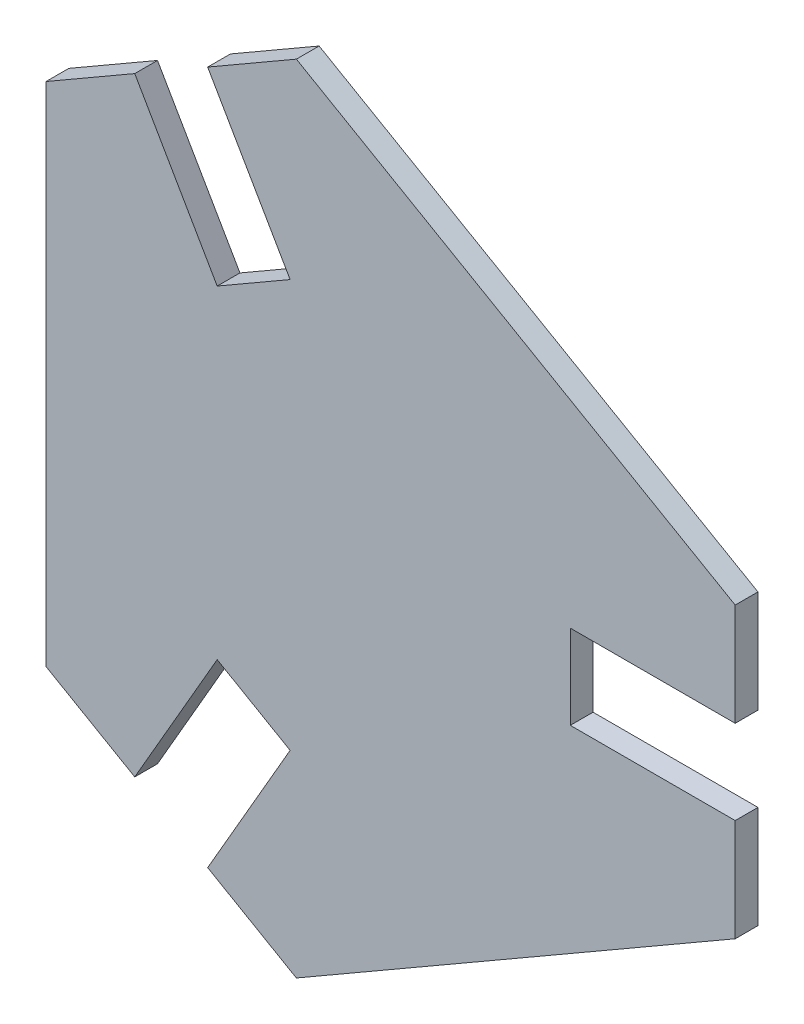
ISO-10303-21;
HEADER;
FILE_DESCRIPTION(('STEP AP214'),'2;1');
FILE_NAME('part.step','',(''),(''),'','','');
FILE_SCHEMA(('AUTOMOTIVE_DESIGN { 1 0 10303 214 1 1 1 1 }'));
ENDSEC;
DATA;
#1=APPLICATION_CONTEXT('core data for automotive mechanical design processes');
#2=APPLICATION_PROTOCOL_DEFINITION('international standard','automotive_design',2000,#1);
#3=PRODUCT_CONTEXT('',#1,'mechanical');
#4=PRODUCT('Part','Part','',(#3));
#5=PRODUCT_RELATED_PRODUCT_CATEGORY('part','',(#4));
#6=PRODUCT_DEFINITION_FORMATION('','',#4);
#7=PRODUCT_DEFINITION_CONTEXT('part definition',#1,'design');
#8=PRODUCT_DEFINITION('design','',#6,#7);
#9=PRODUCT_DEFINITION_SHAPE('','',#8);
#10=(LENGTH_UNIT() NAMED_UNIT(*) SI_UNIT(.MILLI.,.METRE.));
#11=(NAMED_UNIT(*) PLANE_ANGLE_UNIT() SI_UNIT($,.RADIAN.));
#12=(NAMED_UNIT(*) SI_UNIT($,.STERADIAN.) SOLID_ANGLE_UNIT());
#13=UNCERTAINTY_MEASURE_WITH_UNIT(LENGTH_MEASURE(1.E-05),#10,'distance_accuracy_value','');
#14=(GEOMETRIC_REPRESENTATION_CONTEXT(3) GLOBAL_UNCERTAINTY_ASSIGNED_CONTEXT((#13)) GLOBAL_UNIT_ASSIGNED_CONTEXT((#10,
#11,#12)) REPRESENTATION_CONTEXT('',''));
#15=CARTESIAN_POINT('',(0.,0.,0.));
#16=DIRECTION('',(0.,0.,1.));
#17=DIRECTION('',(1.,0.,0.));
#18=AXIS2_PLACEMENT_3D('',#15,#16,#17);
#19=CARTESIAN_POINT('',(-49.3107349850041,66.9086983525934,5.));
#20=DIRECTION('',(0.500000000000001,-0.866025403784438,0.));
#21=DIRECTION('',(0.866025403784438,0.500000000000001,0.));
#22=AXIS2_PLACEMENT_3D('',#19,#20,#21);
#23=PLANE('',#22);
#24=DIRECTION('',(-0.866025403784438,-0.500000000000001,0.));
#25=VECTOR('',#24,1.);
#26=CARTESIAN_POINT('',(-49.3107349850041,66.9086983525934,0.));
#27=LINE('',#26,#25);
#28=CARTESIAN_POINT('',(-49.3107349850041,66.9086983525934,0.));
#29=VERTEX_POINT('',#28);
#30=CARTESIAN_POINT('',(-68.7963065701539,55.6586983525934,0.));
#31=VERTEX_POINT('',#30);
#32=EDGE_CURVE('E188',#29,#31,#27,.T.);
#33=ORIENTED_EDGE('',*,*,#32,.T.);
#34=DIRECTION('',(0.,0.,-1.));
#35=VECTOR('',#34,1.);
#36=CARTESIAN_POINT('',(-68.7963065701539,55.6586983525934,5.));
#37=LINE('',#36,#35);
#38=CARTESIAN_POINT('',(-68.7963065701539,55.6586983525934,5.));
#39=VERTEX_POINT('',#38);
#40=EDGE_CURVE('E11',#39,#31,#37,.T.);
#41=ORIENTED_EDGE('',*,*,#40,.F.);
#42=DIRECTION('',(-0.866025403784438,-0.500000000000001,0.));
#43=VECTOR('',#42,1.);
#44=CARTESIAN_POINT('',(-49.3107349850041,66.9086983525934,5.));
#45=LINE('',#44,#43);
#46=CARTESIAN_POINT('',(-49.3107349850041,66.9086983525934,5.));
#47=VERTEX_POINT('',#46);
#48=EDGE_CURVE('E228',#47,#39,#45,.T.);
#49=ORIENTED_EDGE('',*,*,#48,.F.);
#50=DIRECTION('',(0.,0.,-1.));
#51=VECTOR('',#50,1.);
#52=CARTESIAN_POINT('',(-49.3107349850041,66.9086983525934,5.));
#53=LINE('',#52,#51);
#54=EDGE_CURVE('E184',#47,#29,#53,.T.);
#55=ORIENTED_EDGE('',*,*,#54,.T.);
#56=EDGE_LOOP('',(#33,#41,#49,#55));
#57=FACE_BOUND('',#56,.T.);
#58=ADVANCED_FACE('F33',(#57),#23,.F.);
#59=CARTESIAN_POINT('',(-68.7963065701539,55.6586983525934,5.));
#60=DIRECTION('',(1.,0.,0.));
#61=DIRECTION('',(0.,1.,0.));
#62=AXIS2_PLACEMENT_3D('',#59,#60,#61);
#63=PLANE('',#62);
#64=DIRECTION('',(0.,-1.,0.));
#65=VECTOR('',#64,1.);
#66=CARTESIAN_POINT('',(-68.7963065701539,55.6586983525934,0.));
#67=LINE('',#66,#65);
#68=CARTESIAN_POINT('',(-68.7963065701539,-55.6586983525935,0.));
#69=VERTEX_POINT('',#68);
#70=EDGE_CURVE('E191',#31,#69,#67,.T.);
#71=ORIENTED_EDGE('',*,*,#70,.T.);
#72=DIRECTION('',(0.,0.,-1.));
#73=VECTOR('',#72,1.);
#74=CARTESIAN_POINT('',(-68.7963065701539,-55.6586983525935,5.));
#75=LINE('',#74,#73);
#76=CARTESIAN_POINT('',(-68.7963065701539,-55.6586983525935,5.));
#77=VERTEX_POINT('',#76);
#78=EDGE_CURVE('E41',#77,#69,#75,.T.);
#79=ORIENTED_EDGE('',*,*,#78,.F.);
#80=DIRECTION('',(0.,-1.,0.));
#81=VECTOR('',#80,1.);
#82=CARTESIAN_POINT('',(-68.7963065701539,55.6586983525934,5.));
#83=LINE('',#82,#81);
#84=EDGE_CURVE('E122',#39,#77,#83,.T.);
#85=ORIENTED_EDGE('',*,*,#84,.F.);
#86=ORIENTED_EDGE('',*,*,#40,.T.);
#87=EDGE_LOOP('',(#71,#79,#85,#86));
#88=FACE_BOUND('',#87,.T.);
#89=ADVANCED_FACE('F269',(#88),#63,.F.);
#90=CARTESIAN_POINT('',(-49.310734985004,-66.9086983525935,5.));
#91=DIRECTION('',(-0.499999999999999,-0.866025403784439,0.));
#92=DIRECTION('',(0.866025403784439,-0.499999999999999,0.));
#93=AXIS2_PLACEMENT_3D('',#90,#91,#92);
#94=PLANE('',#93);
#95=DIRECTION('',(-0.866025403784439,0.499999999999999,0.));
#96=VECTOR('',#95,1.);
#97=CARTESIAN_POINT('',(-49.310734985004,-66.9086983525935,0.));
#98=LINE('',#97,#96);
#99=CARTESIAN_POINT('',(-49.310734985004,-66.9086983525935,0.));
#100=VERTEX_POINT('',#99);
#101=EDGE_CURVE('E194',#100,#69,#98,.T.);
#102=ORIENTED_EDGE('',*,*,#101,.F.);
#103=DIRECTION('',(0.,0.,-1.));
#104=VECTOR('',#103,1.);
#105=CARTESIAN_POINT('',(-49.310734985004,-66.9086983525935,5.));
#106=LINE('',#105,#104);
#107=CARTESIAN_POINT('',(-49.310734985004,-66.9086983525935,5.));
#108=VERTEX_POINT('',#107);
#109=EDGE_CURVE('E262',#108,#100,#106,.T.);
#110=ORIENTED_EDGE('',*,*,#109,.F.);
#111=DIRECTION('',(-0.866025403784439,0.499999999999999,0.));
#112=VECTOR('',#111,1.);
#113=CARTESIAN_POINT('',(-49.310734985004,-66.9086983525935,5.));
#114=LINE('',#113,#112);
#115=EDGE_CURVE('E268',#108,#77,#114,.T.);
#116=ORIENTED_EDGE('',*,*,#115,.T.);
#117=ORIENTED_EDGE('',*,*,#78,.T.);
#118=EDGE_LOOP('',(#102,#110,#116,#117));
#119=FACE_BOUND('',#118,.T.);
#120=ADVANCED_FACE('F266',(#119),#94,.T.);
#121=CARTESIAN_POINT('',(-49.310734985004,-66.9086983525935,5.));
#122=DIRECTION('',(-0.866025403784439,0.5,0.));
#123=DIRECTION('',(-0.5,-0.866025403784439,0.));
#124=AXIS2_PLACEMENT_3D('',#121,#122,#123);
#125=PLANE('',#124);
#126=DIRECTION('',(0.5,0.866025403784439,0.));
#127=VECTOR('',#126,1.);
#128=CARTESIAN_POINT('',(-49.310734985004,-66.9086983525935,0.));
#129=LINE('',#128,#127);
#130=CARTESIAN_POINT('',(-31.198621019148,-35.5375967312531,0.));
#131=VERTEX_POINT('',#130);
#132=EDGE_CURVE('E197',#100,#131,#129,.T.);
#133=ORIENTED_EDGE('',*,*,#132,.T.);
#134=DIRECTION('',(0.,0.,-1.));
#135=VECTOR('',#134,1.);
#136=CARTESIAN_POINT('',(-31.198621019148,-35.5375967312531,5.));
#137=LINE('',#136,#135);
#138=CARTESIAN_POINT('',(-31.198621019148,-35.5375967312531,5.));
#139=VERTEX_POINT('',#138);
#140=EDGE_CURVE('E259',#139,#131,#137,.T.);
#141=ORIENTED_EDGE('',*,*,#140,.F.);
#142=DIRECTION('',(0.5,0.866025403784439,0.));
#143=VECTOR('',#142,1.);
#144=CARTESIAN_POINT('',(-49.310734985004,-66.9086983525935,5.));
#145=LINE('',#144,#143);
#146=EDGE_CURVE('E288',#108,#139,#145,.T.);
#147=ORIENTED_EDGE('',*,*,#146,.F.);
#148=ORIENTED_EDGE('',*,*,#109,.T.);
#149=EDGE_LOOP('',(#133,#141,#147,#148));
#150=FACE_BOUND('',#149,.T.);
#151=ADVANCED_FACE('F279',(#150),#125,.F.);
#152=CARTESIAN_POINT('',(-31.198621019148,-35.5375967312531,5.));
#153=DIRECTION('',(0.5,0.866025403784439,0.));
#154=DIRECTION('',(-0.866025403784439,0.5,0.));
#155=AXIS2_PLACEMENT_3D('',#152,#153,#154);
#156=PLANE('',#155);
#157=DIRECTION('',(0.866025403784439,-0.5,0.));
#158=VECTOR('',#157,1.);
#159=CARTESIAN_POINT('',(-31.198621019148,-35.5375967312531,0.));
#160=LINE('',#159,#158);
#161=CARTESIAN_POINT('',(-15.1771510491359,-44.7875967312531,0.));
#162=VERTEX_POINT('',#161);
#163=EDGE_CURVE('E199',#131,#162,#160,.T.);
#164=ORIENTED_EDGE('',*,*,#163,.T.);
#165=DIRECTION('',(0.,0.,-1.));
#166=VECTOR('',#165,1.);
#167=CARTESIAN_POINT('',(-15.1771510491359,-44.7875967312531,5.));
#168=LINE('',#167,#166);
#169=CARTESIAN_POINT('',(-15.1771510491359,-44.7875967312531,5.));
#170=VERTEX_POINT('',#169);
#171=EDGE_CURVE('E256',#170,#162,#168,.T.);
#172=ORIENTED_EDGE('',*,*,#171,.F.);
#173=DIRECTION('',(0.866025403784439,-0.5,0.));
#174=VECTOR('',#173,1.);
#175=CARTESIAN_POINT('',(-31.198621019148,-35.5375967312531,5.));
#176=LINE('',#175,#174);
#177=EDGE_CURVE('E285',#139,#170,#176,.T.);
#178=ORIENTED_EDGE('',*,*,#177,.F.);
#179=ORIENTED_EDGE('',*,*,#140,.T.);
#180=EDGE_LOOP('',(#164,#172,#178,#179));
#181=FACE_BOUND('',#180,.T.);
#182=ADVANCED_FACE('F283',(#181),#156,.F.);
#183=CARTESIAN_POINT('',(-15.1771510491359,-44.7875967312531,5.));
#184=DIRECTION('',(0.866025403784439,-0.5,0.));
#185=DIRECTION('',(0.5,0.866025403784439,0.));
#186=AXIS2_PLACEMENT_3D('',#183,#184,#185);
#187=PLANE('',#186);
#188=DIRECTION('',(-0.5,-0.866025403784439,0.));
#189=VECTOR('',#188,1.);
#190=CARTESIAN_POINT('',(-15.1771510491359,-44.7875967312531,0.));
#191=LINE('',#190,#189);
#192=CARTESIAN_POINT('',(-33.2892650149919,-76.1586983525935,0.));
#193=VERTEX_POINT('',#192);
#194=EDGE_CURVE('E201',#162,#193,#191,.T.);
#195=ORIENTED_EDGE('',*,*,#194,.T.);
#196=DIRECTION('',(0.,0.,-1.));
#197=VECTOR('',#196,1.);
#198=CARTESIAN_POINT('',(-33.2892650149919,-76.1586983525935,5.));
#199=LINE('',#198,#197);
#200=CARTESIAN_POINT('',(-33.2892650149919,-76.1586983525935,5.));
#201=VERTEX_POINT('',#200);
#202=EDGE_CURVE('E253',#201,#193,#199,.T.);
#203=ORIENTED_EDGE('',*,*,#202,.F.);
#204=DIRECTION('',(-0.5,-0.866025403784439,0.));
#205=VECTOR('',#204,1.);
#206=CARTESIAN_POINT('',(-15.1771510491359,-44.7875967312531,5.));
#207=LINE('',#206,#205);
#208=EDGE_CURVE('E287',#170,#201,#207,.T.);
#209=ORIENTED_EDGE('',*,*,#208,.F.);
#210=ORIENTED_EDGE('',*,*,#171,.T.);
#211=EDGE_LOOP('',(#195,#203,#209,#210));
#212=FACE_BOUND('',#211,.T.);
#213=ADVANCED_FACE('F340',(#212),#187,.F.);
#214=CARTESIAN_POINT('',(-33.2892650149919,-76.1586983525935,5.));
#215=DIRECTION('',(0.499999999999999,0.866025403784439,0.));
#216=DIRECTION('',(-0.866025403784439,0.499999999999999,0.));
#217=AXIS2_PLACEMENT_3D('',#214,#215,#216);
#218=PLANE('',#217);
#219=DIRECTION('',(0.866025403784439,-0.499999999999999,0.));
#220=VECTOR('',#219,1.);
#221=CARTESIAN_POINT('',(-33.2892650149919,-76.1586983525935,0.));
#222=LINE('',#221,#220);
#223=CARTESIAN_POINT('',(-13.803693429842,-87.4086983525934,0.));
#224=VERTEX_POINT('',#223);
#225=EDGE_CURVE('E203',#193,#224,#222,.T.);
#226=ORIENTED_EDGE('',*,*,#225,.T.);
#227=DIRECTION('',(0.,0.,-1.));
#228=VECTOR('',#227,1.);
#229=CARTESIAN_POINT('',(-13.803693429842,-87.4086983525934,5.));
#230=LINE('',#229,#228);
#231=CARTESIAN_POINT('',(-13.803693429842,-87.4086983525934,5.));
#232=VERTEX_POINT('',#231);
#233=EDGE_CURVE('E250',#232,#224,#230,.T.);
#234=ORIENTED_EDGE('',*,*,#233,.F.);
#235=DIRECTION('',(0.866025403784439,-0.499999999999999,0.));
#236=VECTOR('',#235,1.);
#237=CARTESIAN_POINT('',(-33.2892650149919,-76.1586983525935,5.));
#238=LINE('',#237,#236);
#239=EDGE_CURVE('E290',#201,#232,#238,.T.);
#240=ORIENTED_EDGE('',*,*,#239,.F.);
#241=ORIENTED_EDGE('',*,*,#202,.T.);
#242=EDGE_LOOP('',(#226,#234,#240,#241));
#243=FACE_BOUND('',#242,.T.);
#244=ADVANCED_FACE('F343',(#243),#218,.F.);
#245=CARTESIAN_POINT('',(-13.803693429842,-87.4086983525934,5.));
#246=DIRECTION('',(-0.5,0.866025403784439,0.));
#247=DIRECTION('',(-0.866025403784439,-0.5,0.));
#248=AXIS2_PLACEMENT_3D('',#245,#246,#247);
#249=PLANE('',#248);
#250=DIRECTION('',(0.866025403784439,0.5,0.));
#251=VECTOR('',#250,1.);
#252=CARTESIAN_POINT('',(-13.803693429842,-87.4086983525934,0.));
#253=LINE('',#252,#251);
#254=CARTESIAN_POINT('',(82.6,-31.75,0.));
#255=VERTEX_POINT('',#254);
#256=EDGE_CURVE('E205',#224,#255,#253,.T.);
#257=ORIENTED_EDGE('',*,*,#256,.T.);
#258=DIRECTION('',(0.,0.,-1.));
#259=VECTOR('',#258,1.);
#260=CARTESIAN_POINT('',(82.6,-31.75,5.));
#261=LINE('',#260,#259);
#262=CARTESIAN_POINT('',(82.6,-31.75,5.));
#263=VERTEX_POINT('',#262);
#264=EDGE_CURVE('E248',#263,#255,#261,.T.);
#265=ORIENTED_EDGE('',*,*,#264,.F.);
#266=DIRECTION('',(0.866025403784439,0.5,0.));
#267=VECTOR('',#266,1.);
#268=CARTESIAN_POINT('',(-13.803693429842,-87.4086983525934,5.));
#269=LINE('',#268,#267);
#270=EDGE_CURVE('E296',#232,#263,#269,.T.);
#271=ORIENTED_EDGE('',*,*,#270,.F.);
#272=ORIENTED_EDGE('',*,*,#233,.T.);
#273=EDGE_LOOP('',(#257,#265,#271,#272));
#274=FACE_BOUND('',#273,.T.);
#275=ADVANCED_FACE('F347',(#274),#249,.F.);
#276=CARTESIAN_POINT('',(82.6,-9.25,5.));
#277=DIRECTION('',(1.,0.,0.));
#278=DIRECTION('',(0.,0.,-1.));
#279=AXIS2_PLACEMENT_3D('',#276,#277,#278);
#280=PLANE('',#279);
#281=DIRECTION('',(0.,-1.,0.));
#282=VECTOR('',#281,1.);
#283=CARTESIAN_POINT('',(82.6,-9.25,0.));
#284=LINE('',#283,#282);
#285=CARTESIAN_POINT('',(82.6,-9.25,0.));
#286=VERTEX_POINT('',#285);
#287=EDGE_CURVE('E208',#286,#255,#284,.T.);
#288=ORIENTED_EDGE('',*,*,#287,.F.);
#289=DIRECTION('',(0.,0.,-1.));
#290=VECTOR('',#289,1.);
#291=CARTESIAN_POINT('',(82.6,-9.25,5.));
#292=LINE('',#291,#290);
#293=CARTESIAN_POINT('',(82.6,-9.25,5.));
#294=VERTEX_POINT('',#293);
#295=EDGE_CURVE('E246',#294,#286,#292,.T.);
#296=ORIENTED_EDGE('',*,*,#295,.F.);
#297=DIRECTION('',(0.,-1.,0.));
#298=VECTOR('',#297,1.);
#299=CARTESIAN_POINT('',(82.6,-9.25,5.));
#300=LINE('',#299,#298);
#301=EDGE_CURVE('E298',#294,#263,#300,.T.);
#302=ORIENTED_EDGE('',*,*,#301,.T.);
#303=ORIENTED_EDGE('',*,*,#264,.T.);
#304=EDGE_LOOP('',(#288,#296,#302,#303));
#305=FACE_BOUND('',#304,.T.);
#306=ADVANCED_FACE('F351',(#305),#280,.T.);
#307=CARTESIAN_POINT('',(82.6,-9.25,5.));
#308=DIRECTION('',(0.,-1.,0.));
#309=DIRECTION('',(1.,0.,0.));
#310=AXIS2_PLACEMENT_3D('',#307,#308,#309);
#311=PLANE('',#310);
#312=DIRECTION('',(-1.,0.,0.));
#313=VECTOR('',#312,1.);
#314=CARTESIAN_POINT('',(82.6,-9.25,0.));
#315=LINE('',#314,#313);
#316=CARTESIAN_POINT('',(46.375772068288,-9.25,0.));
#317=VERTEX_POINT('',#316);
#318=EDGE_CURVE('E211',#286,#317,#315,.T.);
#319=ORIENTED_EDGE('',*,*,#318,.T.);
#320=DIRECTION('',(0.,0.,-1.));
#321=VECTOR('',#320,1.);
#322=CARTESIAN_POINT('',(46.375772068288,-9.25,5.));
#323=LINE('',#322,#321);
#324=CARTESIAN_POINT('',(46.375772068288,-9.25,5.));
#325=VERTEX_POINT('',#324);
#326=EDGE_CURVE('E243',#325,#317,#323,.T.);
#327=ORIENTED_EDGE('',*,*,#326,.F.);
#328=DIRECTION('',(-1.,0.,0.));
#329=VECTOR('',#328,1.);
#330=CARTESIAN_POINT('',(82.6,-9.25,5.));
#331=LINE('',#330,#329);
#332=EDGE_CURVE('E301',#294,#325,#331,.T.);
#333=ORIENTED_EDGE('',*,*,#332,.F.);
#334=ORIENTED_EDGE('',*,*,#295,.T.);
#335=EDGE_LOOP('',(#319,#327,#333,#334));
#336=FACE_BOUND('',#335,.T.);
#337=ADVANCED_FACE('F355',(#336),#311,.F.);
#338=CARTESIAN_POINT('',(46.375772068288,-9.25,5.));
#339=DIRECTION('',(-1.,0.,0.));
#340=DIRECTION('',(0.,0.,1.));
#341=AXIS2_PLACEMENT_3D('',#338,#339,#340);
#342=PLANE('',#341);
#343=DIRECTION('',(0.,1.,0.));
#344=VECTOR('',#343,1.);
#345=CARTESIAN_POINT('',(46.375772068288,-9.25,0.));
#346=LINE('',#345,#344);
#347=CARTESIAN_POINT('',(46.375772068288,9.25,0.));
#348=VERTEX_POINT('',#347);
#349=EDGE_CURVE('E213',#317,#348,#346,.T.);
#350=ORIENTED_EDGE('',*,*,#349,.T.);
#351=DIRECTION('',(0.,0.,-1.));
#352=VECTOR('',#351,1.);
#353=CARTESIAN_POINT('',(46.375772068288,9.25,5.));
#354=LINE('',#353,#352);
#355=CARTESIAN_POINT('',(46.375772068288,9.25,5.));
#356=VERTEX_POINT('',#355);
#357=EDGE_CURVE('E240',#356,#348,#354,.T.);
#358=ORIENTED_EDGE('',*,*,#357,.F.);
#359=DIRECTION('',(0.,1.,0.));
#360=VECTOR('',#359,1.);
#361=CARTESIAN_POINT('',(46.375772068288,-9.25,5.));
#362=LINE('',#361,#360);
#363=EDGE_CURVE('E303',#325,#356,#362,.T.);
#364=ORIENTED_EDGE('',*,*,#363,.F.);
#365=ORIENTED_EDGE('',*,*,#326,.T.);
#366=EDGE_LOOP('',(#350,#358,#364,#365));
#367=FACE_BOUND('',#366,.T.);
#368=ADVANCED_FACE('F359',(#367),#342,.F.);
#369=CARTESIAN_POINT('',(46.375772068288,9.25,5.));
#370=DIRECTION('',(0.,1.,0.));
#371=DIRECTION('',(0.,0.,1.));
#372=AXIS2_PLACEMENT_3D('',#369,#370,#371);
#373=PLANE('',#372);
#374=DIRECTION('',(1.,0.,0.));
#375=VECTOR('',#374,1.);
#376=CARTESIAN_POINT('',(46.375772068288,9.25,0.));
#377=LINE('',#376,#375);
#378=CARTESIAN_POINT('',(82.6,9.25,0.));
#379=VERTEX_POINT('',#378);
#380=EDGE_CURVE('E215',#348,#379,#377,.T.);
#381=ORIENTED_EDGE('',*,*,#380,.T.);
#382=DIRECTION('',(0.,0.,-1.));
#383=VECTOR('',#382,1.);
#384=CARTESIAN_POINT('',(82.6,9.25,5.));
#385=LINE('',#384,#383);
#386=CARTESIAN_POINT('',(82.6,9.25,5.));
#387=VERTEX_POINT('',#386);
#388=EDGE_CURVE('E237',#387,#379,#385,.T.);
#389=ORIENTED_EDGE('',*,*,#388,.F.);
#390=DIRECTION('',(1.,0.,0.));
#391=VECTOR('',#390,1.);
#392=CARTESIAN_POINT('',(46.375772068288,9.25,5.));
#393=LINE('',#392,#391);
#394=EDGE_CURVE('E305',#356,#387,#393,.T.);
#395=ORIENTED_EDGE('',*,*,#394,.F.);
#396=ORIENTED_EDGE('',*,*,#357,.T.);
#397=EDGE_LOOP('',(#381,#389,#395,#396));
#398=FACE_BOUND('',#397,.T.);
#399=ADVANCED_FACE('F363',(#398),#373,.F.);
#400=CARTESIAN_POINT('',(82.6,9.25,5.));
#401=DIRECTION('',(-1.,0.,0.));
#402=DIRECTION('',(0.,0.,1.));
#403=AXIS2_PLACEMENT_3D('',#400,#401,#402);
#404=PLANE('',#403);
#405=DIRECTION('',(0.,1.,0.));
#406=VECTOR('',#405,1.);
#407=CARTESIAN_POINT('',(82.6,9.25,0.));
#408=LINE('',#407,#406);
#409=CARTESIAN_POINT('',(82.6,31.75,0.));
#410=VERTEX_POINT('',#409);
#411=EDGE_CURVE('E217',#379,#410,#408,.T.);
#412=ORIENTED_EDGE('',*,*,#411,.T.);
#413=DIRECTION('',(0.,0.,-1.));
#414=VECTOR('',#413,1.);
#415=CARTESIAN_POINT('',(82.6,31.75,5.));
#416=LINE('',#415,#414);
#417=CARTESIAN_POINT('',(82.6,31.75,5.));
#418=VERTEX_POINT('',#417);
#419=EDGE_CURVE('E234',#418,#410,#416,.T.);
#420=ORIENTED_EDGE('',*,*,#419,.F.);
#421=DIRECTION('',(0.,1.,0.));
#422=VECTOR('',#421,1.);
#423=CARTESIAN_POINT('',(82.6,9.25,5.));
#424=LINE('',#423,#422);
#425=EDGE_CURVE('E307',#387,#418,#424,.T.);
#426=ORIENTED_EDGE('',*,*,#425,.F.);
#427=ORIENTED_EDGE('',*,*,#388,.T.);
#428=EDGE_LOOP('',(#412,#420,#426,#427));
#429=FACE_BOUND('',#428,.T.);
#430=ADVANCED_FACE('F367',(#429),#404,.F.);
#431=CARTESIAN_POINT('',(82.6,31.75,5.));
#432=DIRECTION('',(-0.5,-0.866025403784439,0.));
#433=DIRECTION('',(0.866025403784439,-0.5,0.));
#434=AXIS2_PLACEMENT_3D('',#431,#432,#433);
#435=PLANE('',#434);
#436=DIRECTION('',(-0.866025403784439,0.5,0.));
#437=VECTOR('',#436,1.);
#438=CARTESIAN_POINT('',(82.6,31.75,0.));
#439=LINE('',#438,#437);
#440=CARTESIAN_POINT('',(-13.8036934298421,87.4086983525934,0.));
#441=VERTEX_POINT('',#440);
#442=EDGE_CURVE('E219',#410,#441,#439,.T.);
#443=ORIENTED_EDGE('',*,*,#442,.T.);
#444=DIRECTION('',(0.,0.,-1.));
#445=VECTOR('',#444,1.);
#446=CARTESIAN_POINT('',(-13.8036934298421,87.4086983525934,5.));
#447=LINE('',#446,#445);
#448=CARTESIAN_POINT('',(-13.8036934298421,87.4086983525934,5.));
#449=VERTEX_POINT('',#448);
#450=EDGE_CURVE('E232',#449,#441,#447,.T.);
#451=ORIENTED_EDGE('',*,*,#450,.F.);
#452=DIRECTION('',(-0.866025403784439,0.5,0.));
#453=VECTOR('',#452,1.);
#454=CARTESIAN_POINT('',(82.6,31.75,5.));
#455=LINE('',#454,#453);
#456=EDGE_CURVE('E309',#418,#449,#455,.T.);
#457=ORIENTED_EDGE('',*,*,#456,.F.);
#458=ORIENTED_EDGE('',*,*,#419,.T.);
#459=EDGE_LOOP('',(#443,#451,#457,#458));
#460=FACE_BOUND('',#459,.T.);
#461=ADVANCED_FACE('F371',(#460),#435,.F.);
#462=CARTESIAN_POINT('',(-33.289265014992,76.1586983525934,5.));
#463=DIRECTION('',(-0.5,0.866025403784438,0.));
#464=DIRECTION('',(-0.866025403784438,-0.500000000000001,0.));
#465=AXIS2_PLACEMENT_3D('',#462,#463,#464);
#466=PLANE('',#465);
#467=DIRECTION('',(0.866025403784438,0.5,0.));
#468=VECTOR('',#467,1.);
#469=CARTESIAN_POINT('',(-33.289265014992,76.1586983525934,0.));
#470=LINE('',#469,#468);
#471=CARTESIAN_POINT('',(-33.289265014992,76.1586983525934,0.));
#472=VERTEX_POINT('',#471);
#473=EDGE_CURVE('E222',#472,#441,#470,.T.);
#474=ORIENTED_EDGE('',*,*,#473,.F.);
#475=DIRECTION('',(0.,0.,-1.));
#476=VECTOR('',#475,1.);
#477=CARTESIAN_POINT('',(-33.289265014992,76.1586983525934,5.));
#478=LINE('',#477,#476);
#479=CARTESIAN_POINT('',(-33.289265014992,76.1586983525934,5.));
#480=VERTEX_POINT('',#479);
#481=EDGE_CURVE('E179',#480,#472,#478,.T.);
#482=ORIENTED_EDGE('',*,*,#481,.F.);
#483=DIRECTION('',(0.866025403784438,0.5,0.));
#484=VECTOR('',#483,1.);
#485=CARTESIAN_POINT('',(-33.289265014992,76.1586983525934,5.));
#486=LINE('',#485,#484);
#487=EDGE_CURVE('E172',#480,#449,#486,.T.);
#488=ORIENTED_EDGE('',*,*,#487,.T.);
#489=ORIENTED_EDGE('',*,*,#450,.T.);
#490=EDGE_LOOP('',(#474,#482,#488,#489));
#491=FACE_BOUND('',#490,.T.);
#492=ADVANCED_FACE('F312',(#491),#466,.T.);
#493=CARTESIAN_POINT('',(-33.289265014992,76.1586983525934,5.));
#494=DIRECTION('',(0.866025403784438,0.500000000000001,0.));
#495=DIRECTION('',(-0.500000000000001,0.866025403784438,0.));
#496=AXIS2_PLACEMENT_3D('',#493,#494,#495);
#497=PLANE('',#496);
#498=DIRECTION('',(0.500000000000001,-0.866025403784438,0.));
#499=VECTOR('',#498,1.);
#500=CARTESIAN_POINT('',(-33.289265014992,76.1586983525934,0.));
#501=LINE('',#500,#499);
#502=CARTESIAN_POINT('',(-15.1771510491359,44.787596731253,0.));
#503=VERTEX_POINT('',#502);
#504=EDGE_CURVE('E178',#472,#503,#501,.T.);
#505=ORIENTED_EDGE('',*,*,#504,.T.);
#506=DIRECTION('',(0.,0.,-1.));
#507=VECTOR('',#506,1.);
#508=CARTESIAN_POINT('',(-15.1771510491359,44.787596731253,5.));
#509=LINE('',#508,#507);
#510=CARTESIAN_POINT('',(-15.1771510491359,44.787596731253,5.));
#511=VERTEX_POINT('',#510);
#512=EDGE_CURVE('E175',#511,#503,#509,.T.);
#513=ORIENTED_EDGE('',*,*,#512,.F.);
#514=DIRECTION('',(0.500000000000001,-0.866025403784438,0.));
#515=VECTOR('',#514,1.);
#516=CARTESIAN_POINT('',(-33.289265014992,76.1586983525934,5.));
#517=LINE('',#516,#515);
#518=EDGE_CURVE('E166',#480,#511,#517,.T.);
#519=ORIENTED_EDGE('',*,*,#518,.F.);
#520=ORIENTED_EDGE('',*,*,#481,.T.);
#521=EDGE_LOOP('',(#505,#513,#519,#520));
#522=FACE_BOUND('',#521,.T.);
#523=ADVANCED_FACE('F176',(#522),#497,.F.);
#524=CARTESIAN_POINT('',(-15.1771510491359,44.787596731253,5.));
#525=DIRECTION('',(0.5,-0.866025403784438,0.));
#526=DIRECTION('',(0.866025403784439,0.5,0.));
#527=AXIS2_PLACEMENT_3D('',#524,#525,#526);
#528=PLANE('',#527);
#529=DIRECTION('',(-0.866025403784438,-0.5,0.));
#530=VECTOR('',#529,1.);
#531=CARTESIAN_POINT('',(-15.1771510491359,44.787596731253,0.));
#532=LINE('',#531,#530);
#533=CARTESIAN_POINT('',(-31.1986210191481,35.537596731253,0.));
#534=VERTEX_POINT('',#533);
#535=EDGE_CURVE('E108',#503,#534,#532,.T.);
#536=ORIENTED_EDGE('',*,*,#535,.T.);
#537=DIRECTION('',(0.,0.,-1.));
#538=VECTOR('',#537,1.);
#539=CARTESIAN_POINT('',(-31.1986210191481,35.537596731253,5.));
#540=LINE('',#539,#538);
#541=CARTESIAN_POINT('',(-31.1986210191481,35.537596731253,5.));
#542=VERTEX_POINT('',#541);
#543=EDGE_CURVE('E180',#542,#534,#540,.T.);
#544=ORIENTED_EDGE('',*,*,#543,.F.);
#545=DIRECTION('',(-0.866025403784438,-0.5,0.));
#546=VECTOR('',#545,1.);
#547=CARTESIAN_POINT('',(-15.1771510491359,44.787596731253,5.));
#548=LINE('',#547,#546);
#549=EDGE_CURVE('E170',#511,#542,#548,.T.);
#550=ORIENTED_EDGE('',*,*,#549,.F.);
#551=ORIENTED_EDGE('',*,*,#512,.T.);
#552=EDGE_LOOP('',(#536,#544,#550,#551));
#553=FACE_BOUND('',#552,.T.);
#554=ADVANCED_FACE('F182',(#553),#528,.F.);
#555=CARTESIAN_POINT('',(-31.1986210191481,35.537596731253,5.));
#556=DIRECTION('',(-0.866025403784438,-0.5,0.));
#557=DIRECTION('',(0.5,-0.866025403784438,0.));
#558=AXIS2_PLACEMENT_3D('',#555,#556,#557);
#559=PLANE('',#558);
#560=DIRECTION('',(-0.5,0.866025403784438,0.));
#561=VECTOR('',#560,1.);
#562=CARTESIAN_POINT('',(-31.1986210191481,35.537596731253,0.));
#563=LINE('',#562,#561);
#564=EDGE_CURVE('E114',#534,#29,#563,.T.);
#565=ORIENTED_EDGE('',*,*,#564,.T.);
#566=ORIENTED_EDGE('',*,*,#54,.F.);
#567=DIRECTION('',(-0.5,0.866025403784438,0.));
#568=VECTOR('',#567,1.);
#569=CARTESIAN_POINT('',(-31.1986210191481,35.537596731253,5.));
#570=LINE('',#569,#568);
#571=EDGE_CURVE('E49',#542,#47,#570,.T.);
#572=ORIENTED_EDGE('',*,*,#571,.F.);
#573=ORIENTED_EDGE('',*,*,#543,.T.);
#574=EDGE_LOOP('',(#565,#566,#572,#573));
#575=FACE_BOUND('',#574,.T.);
#576=ADVANCED_FACE('F317',(#575),#559,.F.);
#577=CARTESIAN_POINT('',(0.,0.,5.));
#578=DIRECTION('',(0.,0.,1.));
#579=DIRECTION('',(1.,0.,0.));
#580=AXIS2_PLACEMENT_3D('',#577,#578,#579);
#581=PLANE('',#580);
#582=ORIENTED_EDGE('',*,*,#48,.T.);
#583=ORIENTED_EDGE('',*,*,#84,.T.);
#584=ORIENTED_EDGE('',*,*,#115,.F.);
#585=ORIENTED_EDGE('',*,*,#146,.T.);
#586=ORIENTED_EDGE('',*,*,#177,.T.);
#587=ORIENTED_EDGE('',*,*,#208,.T.);
#588=ORIENTED_EDGE('',*,*,#239,.T.);
#589=ORIENTED_EDGE('',*,*,#270,.T.);
#590=ORIENTED_EDGE('',*,*,#301,.F.);
#591=ORIENTED_EDGE('',*,*,#332,.T.);
#592=ORIENTED_EDGE('',*,*,#363,.T.);
#593=ORIENTED_EDGE('',*,*,#394,.T.);
#594=ORIENTED_EDGE('',*,*,#425,.T.);
#595=ORIENTED_EDGE('',*,*,#456,.T.);
#596=ORIENTED_EDGE('',*,*,#487,.F.);
#597=ORIENTED_EDGE('',*,*,#518,.T.);
#598=ORIENTED_EDGE('',*,*,#549,.T.);
#599=ORIENTED_EDGE('',*,*,#571,.T.);
#600=EDGE_LOOP('',(#582,#583,#584,#585,#586,#587,#588,#589,#590,#591,#592,#593,#594,#595,#596,
#597,#598,#599));
#601=FACE_BOUND('',#600,.T.);
#602=ADVANCED_FACE('F168',(#601),#581,.T.);
#603=CARTESIAN_POINT('',(0.,0.,0.));
#604=DIRECTION('',(0.,0.,1.));
#605=DIRECTION('',(1.,0.,0.));
#606=AXIS2_PLACEMENT_3D('',#603,#604,#605);
#607=PLANE('',#606);
#608=ORIENTED_EDGE('',*,*,#32,.F.);
#609=ORIENTED_EDGE('',*,*,#564,.F.);
#610=ORIENTED_EDGE('',*,*,#535,.F.);
#611=ORIENTED_EDGE('',*,*,#504,.F.);
#612=ORIENTED_EDGE('',*,*,#473,.T.);
#613=ORIENTED_EDGE('',*,*,#442,.F.);
#614=ORIENTED_EDGE('',*,*,#411,.F.);
#615=ORIENTED_EDGE('',*,*,#380,.F.);
#616=ORIENTED_EDGE('',*,*,#349,.F.);
#617=ORIENTED_EDGE('',*,*,#318,.F.);
#618=ORIENTED_EDGE('',*,*,#287,.T.);
#619=ORIENTED_EDGE('',*,*,#256,.F.);
#620=ORIENTED_EDGE('',*,*,#225,.F.);
#621=ORIENTED_EDGE('',*,*,#194,.F.);
#622=ORIENTED_EDGE('',*,*,#163,.F.);
#623=ORIENTED_EDGE('',*,*,#132,.F.);
#624=ORIENTED_EDGE('',*,*,#101,.T.);
#625=ORIENTED_EDGE('',*,*,#70,.F.);
#626=EDGE_LOOP('',(#608,#609,#610,#611,#612,#613,#614,#615,#616,#617,#618,#619,#620,#621,#622,
#623,#624,#625));
#627=FACE_BOUND('',#626,.T.);
#628=ADVANCED_FACE('F274',(#627),#607,.F.);
#629=CLOSED_SHELL('',(#58,#89,#120,#151,#182,#213,#244,#275,#306,#337,#368,#399,#430,#461,#492,
#523,#554,#576,#602,#628));
#630=MANIFOLD_SOLID_BREP('B2',#629);
#631=ADVANCED_BREP_SHAPE_REPRESENTATION('',(#18,#630),#14);
#632=SHAPE_DEFINITION_REPRESENTATION(#9,#631);
ENDSEC;
END-ISO-10303-21;
